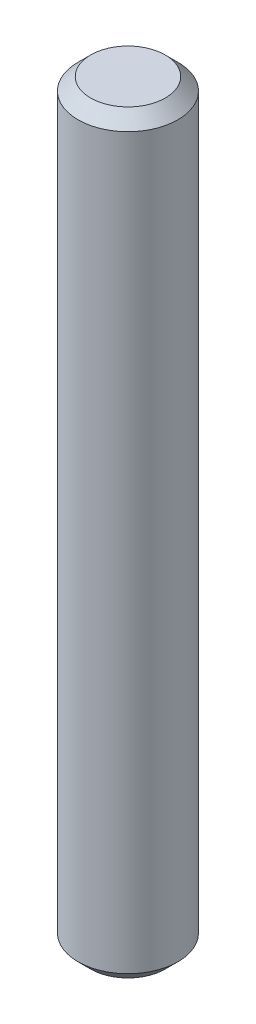
ISO-10303-21;
HEADER;
FILE_DESCRIPTION(('STEP AP214'),'2;1');
FILE_NAME('part.step','',(''),(''),'','','');
FILE_SCHEMA(('AUTOMOTIVE_DESIGN { 1 0 10303 214 1 1 1 1 }'));
ENDSEC;
DATA;
#1=APPLICATION_CONTEXT('core data for automotive mechanical design processes');
#2=APPLICATION_PROTOCOL_DEFINITION('international standard','automotive_design',2000,#1);
#3=PRODUCT_CONTEXT('',#1,'mechanical');
#4=PRODUCT('Part','Part','',(#3));
#5=PRODUCT_RELATED_PRODUCT_CATEGORY('part','',(#4));
#6=PRODUCT_DEFINITION_FORMATION('','',#4);
#7=PRODUCT_DEFINITION_CONTEXT('part definition',#1,'design');
#8=PRODUCT_DEFINITION('design','',#6,#7);
#9=PRODUCT_DEFINITION_SHAPE('','',#8);
#10=(LENGTH_UNIT() NAMED_UNIT(*) SI_UNIT(.MILLI.,.METRE.));
#11=(NAMED_UNIT(*) PLANE_ANGLE_UNIT() SI_UNIT($,.RADIAN.));
#12=(NAMED_UNIT(*) SI_UNIT($,.STERADIAN.) SOLID_ANGLE_UNIT());
#13=UNCERTAINTY_MEASURE_WITH_UNIT(LENGTH_MEASURE(1.E-05),#10,'distance_accuracy_value','');
#14=(GEOMETRIC_REPRESENTATION_CONTEXT(3) GLOBAL_UNCERTAINTY_ASSIGNED_CONTEXT((#13)) GLOBAL_UNIT_ASSIGNED_CONTEXT((#10,
#11,#12)) REPRESENTATION_CONTEXT('',''));
#15=CARTESIAN_POINT('',(0.,0.,0.));
#16=DIRECTION('',(0.,0.,1.));
#17=DIRECTION('',(1.,0.,0.));
#18=AXIS2_PLACEMENT_3D('',#15,#16,#17);
#19=CARTESIAN_POINT('',(0.,60.,0.));
#20=DIRECTION('',(0.,-1.,0.));
#21=DIRECTION('',(0.,0.,-1.));
#22=AXIS2_PLACEMENT_3D('',#19,#20,#21);
#23=CYLINDRICAL_SURFACE('',#22,3.96875);
#24=CARTESIAN_POINT('',(0.,1.00000000000001,0.));
#25=DIRECTION('',(0.,1.,0.));
#26=DIRECTION('',(0.,0.,1.));
#27=AXIS2_PLACEMENT_3D('',#24,#25,#26);
#28=CIRCLE('',#27,3.96875);
#29=CARTESIAN_POINT('',(0.,1.00000000000001,3.96875));
#30=VERTEX_POINT('',#29);
#31=EDGE_CURVE('E54',#30,#30,#28,.T.);
#32=ORIENTED_EDGE('',*,*,#31,.T.);
#33=EDGE_LOOP('',(#32));
#34=FACE_BOUND('',#33,.T.);
#35=CARTESIAN_POINT('',(0.,59.,0.));
#36=DIRECTION('',(0.,1.,0.));
#37=DIRECTION('',(0.,0.,1.));
#38=AXIS2_PLACEMENT_3D('',#35,#36,#37);
#39=CIRCLE('',#38,3.96875);
#40=CARTESIAN_POINT('',(0.,59.,3.96875));
#41=VERTEX_POINT('',#40);
#42=EDGE_CURVE('E59',#41,#41,#39,.F.);
#43=ORIENTED_EDGE('',*,*,#42,.T.);
#44=EDGE_LOOP('',(#43));
#45=FACE_BOUND('',#44,.T.);
#46=ADVANCED_FACE('F41',(#34,#45),#23,.T.);
#47=CARTESIAN_POINT('',(0.,60.,0.));
#48=DIRECTION('',(0.,1.,0.));
#49=DIRECTION('',(0.,0.,1.));
#50=AXIS2_PLACEMENT_3D('',#47,#48,#49);
#51=PLANE('',#50);
#52=CARTESIAN_POINT('',(0.,60.,0.));
#53=DIRECTION('',(0.,1.,0.));
#54=DIRECTION('',(0.,0.,1.));
#55=AXIS2_PLACEMENT_3D('',#52,#53,#54);
#56=CIRCLE('',#55,2.96874999999999);
#57=CARTESIAN_POINT('',(0.,60.,2.96874999999999));
#58=VERTEX_POINT('',#57);
#59=EDGE_CURVE('E10',#58,#58,#56,.T.);
#60=ORIENTED_EDGE('',*,*,#59,.T.);
#61=EDGE_LOOP('',(#60));
#62=FACE_BOUND('',#61,.T.);
#63=ADVANCED_FACE('F76',(#62),#51,.T.);
#64=CARTESIAN_POINT('',(0.,0.,0.));
#65=DIRECTION('',(0.,1.,0.));
#66=DIRECTION('',(0.,0.,1.));
#67=AXIS2_PLACEMENT_3D('',#64,#65,#66);
#68=PLANE('',#67);
#69=CARTESIAN_POINT('',(0.,0.,0.));
#70=DIRECTION('',(0.,1.,0.));
#71=DIRECTION('',(0.,0.,1.));
#72=AXIS2_PLACEMENT_3D('',#69,#70,#71);
#73=CIRCLE('',#72,2.96874999999998);
#74=CARTESIAN_POINT('',(0.,0.,2.96874999999998));
#75=VERTEX_POINT('',#74);
#76=EDGE_CURVE('E49',#75,#75,#73,.F.);
#77=ORIENTED_EDGE('',*,*,#76,.T.);
#78=EDGE_LOOP('',(#77));
#79=FACE_BOUND('',#78,.T.);
#80=ADVANCED_FACE('F73',(#79),#68,.F.);
#81=CARTESIAN_POINT('',(0.,1.00000000000001,0.));
#82=DIRECTION('',(0.,1.,0.));
#83=DIRECTION('',(0.,0.,1.));
#84=AXIS2_PLACEMENT_3D('',#81,#82,#83);
#85=CONICAL_SURFACE('',#84,3.96875,0.785398163397452);
#86=ORIENTED_EDGE('',*,*,#76,.F.);
#87=EDGE_LOOP('',(#86));
#88=FACE_BOUND('',#87,.T.);
#89=ORIENTED_EDGE('',*,*,#31,.F.);
#90=EDGE_LOOP('',(#89));
#91=FACE_BOUND('',#90,.T.);
#92=ADVANCED_FACE('F69',(#88,#91),#85,.T.);
#93=CARTESIAN_POINT('',(0.,60.,0.));
#94=DIRECTION('',(0.,-1.,0.));
#95=DIRECTION('',(0.,0.,-1.));
#96=AXIS2_PLACEMENT_3D('',#93,#94,#95);
#97=CONICAL_SURFACE('',#96,2.96874999999999,0.785398163397448);
#98=ORIENTED_EDGE('',*,*,#42,.F.);
#99=EDGE_LOOP('',(#98));
#100=FACE_BOUND('',#99,.T.);
#101=ORIENTED_EDGE('',*,*,#59,.F.);
#102=EDGE_LOOP('',(#101));
#103=FACE_BOUND('',#102,.T.);
#104=ADVANCED_FACE('F43',(#100,#103),#97,.T.);
#105=CLOSED_SHELL('',(#46,#63,#80,#92,#104));
#106=MANIFOLD_SOLID_BREP('B2',#105);
#107=ADVANCED_BREP_SHAPE_REPRESENTATION('',(#18,#106),#14);
#108=SHAPE_DEFINITION_REPRESENTATION(#9,#107);
ENDSEC;
END-ISO-10303-21;
